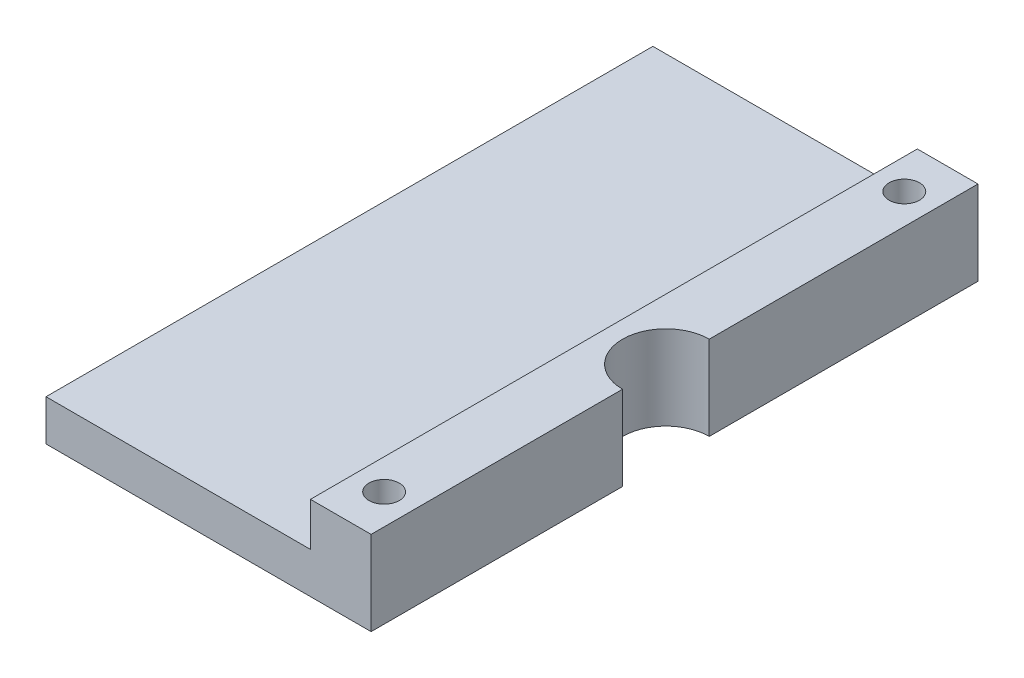
ISO-10303-21;
HEADER;
FILE_DESCRIPTION(('STEP AP214'),'2;1');
FILE_NAME('part.step','',(''),(''),'','','');
FILE_SCHEMA(('AUTOMOTIVE_DESIGN { 1 0 10303 214 1 1 1 1 }'));
ENDSEC;
DATA;
#1=APPLICATION_CONTEXT('core data for automotive mechanical design processes');
#2=APPLICATION_PROTOCOL_DEFINITION('international standard','automotive_design',2000,#1);
#3=PRODUCT_CONTEXT('',#1,'mechanical');
#4=PRODUCT('Part','Part','',(#3));
#5=PRODUCT_RELATED_PRODUCT_CATEGORY('part','',(#4));
#6=PRODUCT_DEFINITION_FORMATION('','',#4);
#7=PRODUCT_DEFINITION_CONTEXT('part definition',#1,'design');
#8=PRODUCT_DEFINITION('design','',#6,#7);
#9=PRODUCT_DEFINITION_SHAPE('','',#8);
#10=(LENGTH_UNIT() NAMED_UNIT(*) SI_UNIT(.MILLI.,.METRE.));
#11=(NAMED_UNIT(*) PLANE_ANGLE_UNIT() SI_UNIT($,.RADIAN.));
#12=(NAMED_UNIT(*) SI_UNIT($,.STERADIAN.) SOLID_ANGLE_UNIT());
#13=UNCERTAINTY_MEASURE_WITH_UNIT(LENGTH_MEASURE(1.E-05),#10,'distance_accuracy_value','');
#14=(GEOMETRIC_REPRESENTATION_CONTEXT(3) GLOBAL_UNCERTAINTY_ASSIGNED_CONTEXT((#13)) GLOBAL_UNIT_ASSIGNED_CONTEXT((#10,
#11,#12)) REPRESENTATION_CONTEXT('',''));
#15=CARTESIAN_POINT('',(0.,0.,0.));
#16=DIRECTION('',(0.,0.,1.));
#17=DIRECTION('',(1.,0.,0.));
#18=AXIS2_PLACEMENT_3D('',#15,#16,#17);
#19=CARTESIAN_POINT('',(50.165,12.3444,0.));
#20=DIRECTION('',(1.,0.,0.));
#21=DIRECTION('',(0.,0.,-1.));
#22=AXIS2_PLACEMENT_3D('',#19,#20,#21);
#23=PLANE('',#22);
#24=DIRECTION('',(0.,1.,0.));
#25=VECTOR('',#24,1.);
#26=CARTESIAN_POINT('',(50.165,0.,-49.53));
#27=LINE('',#26,#25);
#28=CARTESIAN_POINT('',(50.165,0.,-49.53));
#29=VERTEX_POINT('',#28);
#30=CARTESIAN_POINT('',(50.165,12.3444,-49.53));
#31=VERTEX_POINT('',#30);
#32=EDGE_CURVE('E57',#29,#31,#27,.T.);
#33=ORIENTED_EDGE('',*,*,#32,.F.);
#34=DIRECTION('',(0.,0.,1.));
#35=VECTOR('',#34,1.);
#36=CARTESIAN_POINT('',(50.165,0.,0.));
#37=LINE('',#36,#35);
#38=CARTESIAN_POINT('',(50.165,0.,-88.9));
#39=VERTEX_POINT('',#38);
#40=EDGE_CURVE('E121',#39,#29,#37,.T.);
#41=ORIENTED_EDGE('',*,*,#40,.F.);
#42=DIRECTION('',(0.,-1.,0.));
#43=VECTOR('',#42,1.);
#44=CARTESIAN_POINT('',(50.165,12.3444,-88.9));
#45=LINE('',#44,#43);
#46=CARTESIAN_POINT('',(50.165,12.3444,-88.9));
#47=VERTEX_POINT('',#46);
#48=EDGE_CURVE('E151',#47,#39,#45,.T.);
#49=ORIENTED_EDGE('',*,*,#48,.F.);
#50=DIRECTION('',(0.,0.,1.));
#51=VECTOR('',#50,1.);
#52=CARTESIAN_POINT('',(50.165,12.3444,0.));
#53=LINE('',#52,#51);
#54=EDGE_CURVE('E186',#47,#31,#53,.T.);
#55=ORIENTED_EDGE('',*,*,#54,.T.);
#56=EDGE_LOOP('',(#33,#41,#49,#55));
#57=FACE_BOUND('',#56,.T.);
#58=ADVANCED_FACE('F42',(#57),#23,.T.);
#59=CARTESIAN_POINT('',(45.72,0.,-82.55));
#60=DIRECTION('',(0.,1.,0.));
#61=DIRECTION('',(0.,0.,1.));
#62=AXIS2_PLACEMENT_3D('',#59,#60,#61);
#63=CYLINDRICAL_SURFACE('',#62,2.2225);
#64=CARTESIAN_POINT('',(45.72,12.3444,-82.55));
#65=DIRECTION('',(0.,1.,0.));
#66=DIRECTION('',(0.,0.,1.));
#67=AXIS2_PLACEMENT_3D('',#64,#65,#66);
#68=CIRCLE('',#67,2.2225);
#69=CARTESIAN_POINT('',(45.72,12.3444,-80.3275));
#70=VERTEX_POINT('',#69);
#71=EDGE_CURVE('E135',#70,#70,#68,.T.);
#72=ORIENTED_EDGE('',*,*,#71,.T.);
#73=EDGE_LOOP('',(#72));
#74=FACE_BOUND('',#73,.T.);
#75=CARTESIAN_POINT('',(45.72,4.064,-82.55));
#76=DIRECTION('',(0.,-1.,0.));
#77=DIRECTION('',(0.,0.,-1.));
#78=AXIS2_PLACEMENT_3D('',#75,#76,#77);
#79=CIRCLE('',#78,2.2225);
#80=CARTESIAN_POINT('',(45.72,4.064,-84.7725));
#81=VERTEX_POINT('',#80);
#82=EDGE_CURVE('E173',#81,#81,#79,.F.);
#83=ORIENTED_EDGE('',*,*,#82,.F.);
#84=EDGE_LOOP('',(#83));
#85=FACE_BOUND('',#84,.T.);
#86=ADVANCED_FACE('F266',(#74,#85),#63,.F.);
#87=CARTESIAN_POINT('',(45.72,0.,-6.34999999999999));
#88=DIRECTION('',(0.,1.,0.));
#89=DIRECTION('',(0.,0.,1.));
#90=AXIS2_PLACEMENT_3D('',#87,#88,#89);
#91=CYLINDRICAL_SURFACE('',#90,2.2225);
#92=CARTESIAN_POINT('',(45.72,12.3444,-6.34999999999999));
#93=DIRECTION('',(0.,1.,0.));
#94=DIRECTION('',(0.,0.,1.));
#95=AXIS2_PLACEMENT_3D('',#92,#93,#94);
#96=CIRCLE('',#95,2.2225);
#97=CARTESIAN_POINT('',(45.72,12.3444,-4.12749999999999));
#98=VERTEX_POINT('',#97);
#99=EDGE_CURVE('E129',#98,#98,#96,.T.);
#100=ORIENTED_EDGE('',*,*,#99,.T.);
#101=EDGE_LOOP('',(#100));
#102=FACE_BOUND('',#101,.T.);
#103=CARTESIAN_POINT('',(45.72,4.064,-6.34999999999999));
#104=DIRECTION('',(0.,-1.,0.));
#105=DIRECTION('',(0.,0.,-1.));
#106=AXIS2_PLACEMENT_3D('',#103,#104,#105);
#107=CIRCLE('',#106,2.2225);
#108=CARTESIAN_POINT('',(45.72,4.064,-8.5725));
#109=VERTEX_POINT('',#108);
#110=EDGE_CURVE('E170',#109,#109,#107,.F.);
#111=ORIENTED_EDGE('',*,*,#110,.F.);
#112=EDGE_LOOP('',(#111));
#113=FACE_BOUND('',#112,.T.);
#114=ADVANCED_FACE('F271',(#102,#113),#91,.F.);
#115=CARTESIAN_POINT('',(0.,5.9944,0.));
#116=DIRECTION('',(0.,0.,-1.));
#117=DIRECTION('',(-1.,0.,0.));
#118=AXIS2_PLACEMENT_3D('',#115,#116,#117);
#119=PLANE('',#118);
#120=DIRECTION('',(1.,0.,0.));
#121=VECTOR('',#120,1.);
#122=CARTESIAN_POINT('',(0.,5.9944,0.));
#123=LINE('',#122,#121);
#124=CARTESIAN_POINT('',(2.54000000000001,5.9944,0.));
#125=VERTEX_POINT('',#124);
#126=CARTESIAN_POINT('',(41.275,5.9944,0.));
#127=VERTEX_POINT('',#126);
#128=EDGE_CURVE('E156',#125,#127,#123,.T.);
#129=ORIENTED_EDGE('',*,*,#128,.F.);
#130=DIRECTION('',(0.,1.,0.));
#131=VECTOR('',#130,1.);
#132=CARTESIAN_POINT('',(2.54000000000001,0.,0.));
#133=LINE('',#132,#131);
#134=CARTESIAN_POINT('',(2.54000000000001,0.,0.));
#135=VERTEX_POINT('',#134);
#136=EDGE_CURVE('E208',#135,#125,#133,.T.);
#137=ORIENTED_EDGE('',*,*,#136,.F.);
#138=DIRECTION('',(1.,0.,0.));
#139=VECTOR('',#138,1.);
#140=CARTESIAN_POINT('',(0.,0.,0.));
#141=LINE('',#140,#139);
#142=CARTESIAN_POINT('',(50.165,0.,0.));
#143=VERTEX_POINT('',#142);
#144=EDGE_CURVE('E155',#135,#143,#141,.T.);
#145=ORIENTED_EDGE('',*,*,#144,.T.);
#146=DIRECTION('',(0.,-1.,0.));
#147=VECTOR('',#146,1.);
#148=CARTESIAN_POINT('',(50.165,12.3444,0.));
#149=LINE('',#148,#147);
#150=CARTESIAN_POINT('',(50.165,12.3444,0.));
#151=VERTEX_POINT('',#150);
#152=EDGE_CURVE('E127',#151,#143,#149,.T.);
#153=ORIENTED_EDGE('',*,*,#152,.F.);
#154=DIRECTION('',(1.,0.,0.));
#155=VECTOR('',#154,1.);
#156=CARTESIAN_POINT('',(0.,12.3444,0.));
#157=LINE('',#156,#155);
#158=CARTESIAN_POINT('',(41.275,12.3444,0.));
#159=VERTEX_POINT('',#158);
#160=EDGE_CURVE('E139',#159,#151,#157,.T.);
#161=ORIENTED_EDGE('',*,*,#160,.F.);
#162=DIRECTION('',(0.,-1.,0.));
#163=VECTOR('',#162,1.);
#164=CARTESIAN_POINT('',(41.275,12.3444,0.));
#165=LINE('',#164,#163);
#166=EDGE_CURVE('E143',#159,#127,#165,.T.);
#167=ORIENTED_EDGE('',*,*,#166,.T.);
#168=EDGE_LOOP('',(#129,#137,#145,#153,#161,#167));
#169=FACE_BOUND('',#168,.T.);
#170=ADVANCED_FACE('F44',(#169),#119,.F.);
#171=CARTESIAN_POINT('',(0.,5.9944,-88.9));
#172=DIRECTION('',(0.,0.,-1.));
#173=DIRECTION('',(-1.,0.,0.));
#174=AXIS2_PLACEMENT_3D('',#171,#172,#173);
#175=PLANE('',#174);
#176=DIRECTION('',(0.,1.,0.));
#177=VECTOR('',#176,1.);
#178=CARTESIAN_POINT('',(2.54,0.,-88.9));
#179=LINE('',#178,#177);
#180=CARTESIAN_POINT('',(2.54,0.,-88.9));
#181=VERTEX_POINT('',#180);
#182=CARTESIAN_POINT('',(2.54,5.9944,-88.9));
#183=VERTEX_POINT('',#182);
#184=EDGE_CURVE('E65',#181,#183,#179,.T.);
#185=ORIENTED_EDGE('',*,*,#184,.T.);
#186=DIRECTION('',(1.,0.,0.));
#187=VECTOR('',#186,1.);
#188=CARTESIAN_POINT('',(0.,5.9944,-88.9));
#189=LINE('',#188,#187);
#190=CARTESIAN_POINT('',(41.275,5.9944,-88.9));
#191=VERTEX_POINT('',#190);
#192=EDGE_CURVE('E51',#183,#191,#189,.T.);
#193=ORIENTED_EDGE('',*,*,#192,.T.);
#194=DIRECTION('',(0.,-1.,0.));
#195=VECTOR('',#194,1.);
#196=CARTESIAN_POINT('',(41.275,12.3444,-88.9));
#197=LINE('',#196,#195);
#198=CARTESIAN_POINT('',(41.275,12.3444,-88.9));
#199=VERTEX_POINT('',#198);
#200=EDGE_CURVE('E147',#199,#191,#197,.T.);
#201=ORIENTED_EDGE('',*,*,#200,.F.);
#202=DIRECTION('',(1.,0.,0.));
#203=VECTOR('',#202,1.);
#204=CARTESIAN_POINT('',(0.,12.3444,-88.9));
#205=LINE('',#204,#203);
#206=EDGE_CURVE('E190',#199,#47,#205,.T.);
#207=ORIENTED_EDGE('',*,*,#206,.T.);
#208=ORIENTED_EDGE('',*,*,#48,.T.);
#209=DIRECTION('',(1.,0.,0.));
#210=VECTOR('',#209,1.);
#211=CARTESIAN_POINT('',(0.,0.,-88.9));
#212=LINE('',#211,#210);
#213=EDGE_CURVE('E160',#181,#39,#212,.T.);
#214=ORIENTED_EDGE('',*,*,#213,.F.);
#215=EDGE_LOOP('',(#185,#193,#201,#207,#208,#214));
#216=FACE_BOUND('',#215,.T.);
#217=ADVANCED_FACE('F215',(#216),#175,.T.);
#218=CARTESIAN_POINT('',(0.,5.9944,0.));
#219=DIRECTION('',(0.,1.,0.));
#220=DIRECTION('',(0.,0.,1.));
#221=AXIS2_PLACEMENT_3D('',#218,#219,#220);
#222=PLANE('',#221);
#223=DIRECTION('',(0.,0.,-1.));
#224=VECTOR('',#223,1.);
#225=CARTESIAN_POINT('',(2.54,5.9944,-88.9));
#226=LINE('',#225,#224);
#227=EDGE_CURVE('E212',#125,#183,#226,.T.);
#228=ORIENTED_EDGE('',*,*,#227,.F.);
#229=ORIENTED_EDGE('',*,*,#128,.T.);
#230=DIRECTION('',(0.,0.,-1.));
#231=VECTOR('',#230,1.);
#232=CARTESIAN_POINT('',(41.275,5.9944,0.));
#233=LINE('',#232,#231);
#234=EDGE_CURVE('E159',#127,#191,#233,.T.);
#235=ORIENTED_EDGE('',*,*,#234,.T.);
#236=ORIENTED_EDGE('',*,*,#192,.F.);
#237=EDGE_LOOP('',(#228,#229,#235,#236));
#238=FACE_BOUND('',#237,.T.);
#239=ADVANCED_FACE('F254',(#238),#222,.T.);
#240=CARTESIAN_POINT('',(0.,0.,0.));
#241=DIRECTION('',(0.,1.,0.));
#242=DIRECTION('',(0.,0.,1.));
#243=AXIS2_PLACEMENT_3D('',#240,#241,#242);
#244=PLANE('',#243);
#245=CARTESIAN_POINT('',(45.72,0.,-6.34999999999999));
#246=DIRECTION('',(0.,-1.,0.));
#247=DIRECTION('',(0.,0.,-1.));
#248=AXIS2_PLACEMENT_3D('',#245,#246,#247);
#249=CIRCLE('',#248,3.683);
#250=CARTESIAN_POINT('',(45.72,0.,-10.033));
#251=VERTEX_POINT('',#250);
#252=EDGE_CURVE('E232',#251,#251,#249,.T.);
#253=ORIENTED_EDGE('',*,*,#252,.F.);
#254=EDGE_LOOP('',(#253));
#255=FACE_BOUND('',#254,.T.);
#256=CARTESIAN_POINT('',(45.72,0.,-82.55));
#257=DIRECTION('',(0.,-1.,0.));
#258=DIRECTION('',(0.,0.,-1.));
#259=AXIS2_PLACEMENT_3D('',#256,#257,#258);
#260=CIRCLE('',#259,3.683);
#261=CARTESIAN_POINT('',(45.72,0.,-86.233));
#262=VERTEX_POINT('',#261);
#263=EDGE_CURVE('E236',#262,#262,#260,.T.);
#264=ORIENTED_EDGE('',*,*,#263,.F.);
#265=EDGE_LOOP('',(#264));
#266=FACE_BOUND('',#265,.T.);
#267=ORIENTED_EDGE('',*,*,#40,.T.);
#268=CARTESIAN_POINT('',(50.165,0.,-43.18));
#269=DIRECTION('',(0.,1.,0.));
#270=DIRECTION('',(0.,0.,1.));
#271=AXIS2_PLACEMENT_3D('',#268,#269,#270);
#272=CIRCLE('',#271,6.35);
#273=CARTESIAN_POINT('',(50.165,0.,-36.83));
#274=VERTEX_POINT('',#273);
#275=EDGE_CURVE('E108',#29,#274,#272,.T.);
#276=ORIENTED_EDGE('',*,*,#275,.T.);
#277=EDGE_CURVE('E118',#274,#143,#37,.T.);
#278=ORIENTED_EDGE('',*,*,#277,.T.);
#279=ORIENTED_EDGE('',*,*,#144,.F.);
#280=DIRECTION('',(0.,0.,-1.));
#281=VECTOR('',#280,1.);
#282=CARTESIAN_POINT('',(2.54,0.,-88.9));
#283=LINE('',#282,#281);
#284=EDGE_CURVE('E209',#135,#181,#283,.T.);
#285=ORIENTED_EDGE('',*,*,#284,.T.);
#286=ORIENTED_EDGE('',*,*,#213,.T.);
#287=EDGE_LOOP('',(#267,#276,#278,#279,#285,#286));
#288=FACE_BOUND('',#287,.T.);
#289=ADVANCED_FACE('F116',(#255,#266,#288),#244,.F.);
#290=CARTESIAN_POINT('',(41.275,12.3444,0.));
#291=DIRECTION('',(-1.,0.,0.));
#292=DIRECTION('',(0.,0.,1.));
#293=AXIS2_PLACEMENT_3D('',#290,#291,#292);
#294=PLANE('',#293);
#295=ORIENTED_EDGE('',*,*,#234,.F.);
#296=ORIENTED_EDGE('',*,*,#166,.F.);
#297=DIRECTION('',(0.,0.,-1.));
#298=VECTOR('',#297,1.);
#299=CARTESIAN_POINT('',(41.275,12.3444,0.));
#300=LINE('',#299,#298);
#301=EDGE_CURVE('E193',#159,#199,#300,.T.);
#302=ORIENTED_EDGE('',*,*,#301,.T.);
#303=ORIENTED_EDGE('',*,*,#200,.T.);
#304=EDGE_LOOP('',(#295,#296,#302,#303));
#305=FACE_BOUND('',#304,.T.);
#306=ADVANCED_FACE('F253',(#305),#294,.T.);
#307=DIRECTION('',(0.,1.,0.));
#308=VECTOR('',#307,1.);
#309=CARTESIAN_POINT('',(50.165,0.,-36.83));
#310=LINE('',#309,#308);
#311=CARTESIAN_POINT('',(50.165,12.3444,-36.83));
#312=VERTEX_POINT('',#311);
#313=EDGE_CURVE('E105',#312,#274,#310,.F.);
#314=ORIENTED_EDGE('',*,*,#313,.F.);
#315=EDGE_CURVE('E133',#312,#151,#53,.T.);
#316=ORIENTED_EDGE('',*,*,#315,.T.);
#317=ORIENTED_EDGE('',*,*,#152,.T.);
#318=ORIENTED_EDGE('',*,*,#277,.F.);
#319=EDGE_LOOP('',(#314,#316,#317,#318));
#320=FACE_BOUND('',#319,.T.);
#321=ADVANCED_FACE('F125',(#320),#23,.T.);
#322=CARTESIAN_POINT('',(0.,12.3444,0.));
#323=DIRECTION('',(0.,1.,0.));
#324=DIRECTION('',(0.,0.,1.));
#325=AXIS2_PLACEMENT_3D('',#322,#323,#324);
#326=PLANE('',#325);
#327=CARTESIAN_POINT('',(50.165,12.3444,-43.18));
#328=DIRECTION('',(0.,1.,0.));
#329=DIRECTION('',(0.,0.,1.));
#330=AXIS2_PLACEMENT_3D('',#327,#328,#329);
#331=CIRCLE('',#330,6.35);
#332=EDGE_CURVE('E11',#31,#312,#331,.T.);
#333=ORIENTED_EDGE('',*,*,#332,.F.);
#334=ORIENTED_EDGE('',*,*,#54,.F.);
#335=ORIENTED_EDGE('',*,*,#206,.F.);
#336=ORIENTED_EDGE('',*,*,#301,.F.);
#337=ORIENTED_EDGE('',*,*,#160,.T.);
#338=ORIENTED_EDGE('',*,*,#315,.F.);
#339=EDGE_LOOP('',(#333,#334,#335,#336,#337,#338));
#340=FACE_BOUND('',#339,.T.);
#341=ORIENTED_EDGE('',*,*,#99,.F.);
#342=EDGE_LOOP('',(#341));
#343=FACE_BOUND('',#342,.T.);
#344=ORIENTED_EDGE('',*,*,#71,.F.);
#345=EDGE_LOOP('',(#344));
#346=FACE_BOUND('',#345,.T.);
#347=ADVANCED_FACE('F202',(#340,#343,#346),#326,.T.);
#348=CARTESIAN_POINT('',(45.72,4.064,-6.34999999999999));
#349=DIRECTION('',(0.,-1.,0.));
#350=DIRECTION('',(0.,0.,-1.));
#351=AXIS2_PLACEMENT_3D('',#348,#349,#350);
#352=PLANE('',#351);
#353=CARTESIAN_POINT('',(45.72,4.064,-6.34999999999999));
#354=DIRECTION('',(0.,-1.,0.));
#355=DIRECTION('',(0.,0.,-1.));
#356=AXIS2_PLACEMENT_3D('',#353,#354,#355);
#357=CIRCLE('',#356,3.683);
#358=CARTESIAN_POINT('',(45.72,4.064,-10.033));
#359=VERTEX_POINT('',#358);
#360=EDGE_CURVE('E174',#359,#359,#357,.T.);
#361=ORIENTED_EDGE('',*,*,#360,.T.);
#362=EDGE_LOOP('',(#361));
#363=FACE_BOUND('',#362,.T.);
#364=ORIENTED_EDGE('',*,*,#110,.T.);
#365=EDGE_LOOP('',(#364));
#366=FACE_BOUND('',#365,.T.);
#367=ADVANCED_FACE('F277',(#363,#366),#352,.T.);
#368=CARTESIAN_POINT('',(45.72,4.064,-6.34999999999999));
#369=DIRECTION('',(0.,-1.,0.));
#370=DIRECTION('',(0.,0.,-1.));
#371=AXIS2_PLACEMENT_3D('',#368,#369,#370);
#372=CYLINDRICAL_SURFACE('',#371,3.683);
#373=ORIENTED_EDGE('',*,*,#360,.F.);
#374=EDGE_LOOP('',(#373));
#375=FACE_BOUND('',#374,.T.);
#376=ORIENTED_EDGE('',*,*,#252,.T.);
#377=EDGE_LOOP('',(#376));
#378=FACE_BOUND('',#377,.T.);
#379=ADVANCED_FACE('F282',(#375,#378),#372,.F.);
#380=CARTESIAN_POINT('',(45.72,4.064,-82.55));
#381=DIRECTION('',(0.,-1.,0.));
#382=DIRECTION('',(0.,0.,-1.));
#383=AXIS2_PLACEMENT_3D('',#380,#381,#382);
#384=PLANE('',#383);
#385=CARTESIAN_POINT('',(45.72,4.064,-82.55));
#386=DIRECTION('',(0.,-1.,0.));
#387=DIRECTION('',(0.,0.,-1.));
#388=AXIS2_PLACEMENT_3D('',#385,#386,#387);
#389=CIRCLE('',#388,3.683);
#390=CARTESIAN_POINT('',(45.72,4.064,-86.233));
#391=VERTEX_POINT('',#390);
#392=EDGE_CURVE('E226',#391,#391,#389,.T.);
#393=ORIENTED_EDGE('',*,*,#392,.T.);
#394=EDGE_LOOP('',(#393));
#395=FACE_BOUND('',#394,.T.);
#396=ORIENTED_EDGE('',*,*,#82,.T.);
#397=EDGE_LOOP('',(#396));
#398=FACE_BOUND('',#397,.T.);
#399=ADVANCED_FACE('F243',(#395,#398),#384,.T.);
#400=CARTESIAN_POINT('',(45.72,4.064,-82.55));
#401=DIRECTION('',(0.,-1.,0.));
#402=DIRECTION('',(0.,0.,-1.));
#403=AXIS2_PLACEMENT_3D('',#400,#401,#402);
#404=CYLINDRICAL_SURFACE('',#403,3.683);
#405=ORIENTED_EDGE('',*,*,#392,.F.);
#406=EDGE_LOOP('',(#405));
#407=FACE_BOUND('',#406,.T.);
#408=ORIENTED_EDGE('',*,*,#263,.T.);
#409=EDGE_LOOP('',(#408));
#410=FACE_BOUND('',#409,.T.);
#411=ADVANCED_FACE('F245',(#407,#410),#404,.F.);
#412=CARTESIAN_POINT('',(2.54,0.,-88.9));
#413=DIRECTION('',(1.,0.,0.));
#414=DIRECTION('',(0.,0.,-1.));
#415=AXIS2_PLACEMENT_3D('',#412,#413,#414);
#416=PLANE('',#415);
#417=ORIENTED_EDGE('',*,*,#227,.T.);
#418=ORIENTED_EDGE('',*,*,#184,.F.);
#419=ORIENTED_EDGE('',*,*,#284,.F.);
#420=ORIENTED_EDGE('',*,*,#136,.T.);
#421=EDGE_LOOP('',(#417,#418,#419,#420));
#422=FACE_BOUND('',#421,.T.);
#423=ADVANCED_FACE('F248',(#422),#416,.F.);
#424=CARTESIAN_POINT('',(50.165,0.,-43.18));
#425=DIRECTION('',(0.,1.,0.));
#426=DIRECTION('',(0.,0.,1.));
#427=AXIS2_PLACEMENT_3D('',#424,#425,#426);
#428=CYLINDRICAL_SURFACE('',#427,6.35);
#429=ORIENTED_EDGE('',*,*,#32,.T.);
#430=ORIENTED_EDGE('',*,*,#332,.T.);
#431=ORIENTED_EDGE('',*,*,#313,.T.);
#432=ORIENTED_EDGE('',*,*,#275,.F.);
#433=EDGE_LOOP('',(#429,#430,#431,#432));
#434=FACE_BOUND('',#433,.T.);
#435=ADVANCED_FACE('F107',(#434),#428,.F.);
#436=CLOSED_SHELL('',(#58,#86,#114,#170,#217,#239,#289,#306,#321,#347,#367,#379,#399,#411,#423,#435));
#437=MANIFOLD_SOLID_BREP('B2',#436);
#438=ADVANCED_BREP_SHAPE_REPRESENTATION('',(#18,#437),#14);
#439=SHAPE_DEFINITION_REPRESENTATION(#9,#438);
ENDSEC;
END-ISO-10303-21;
